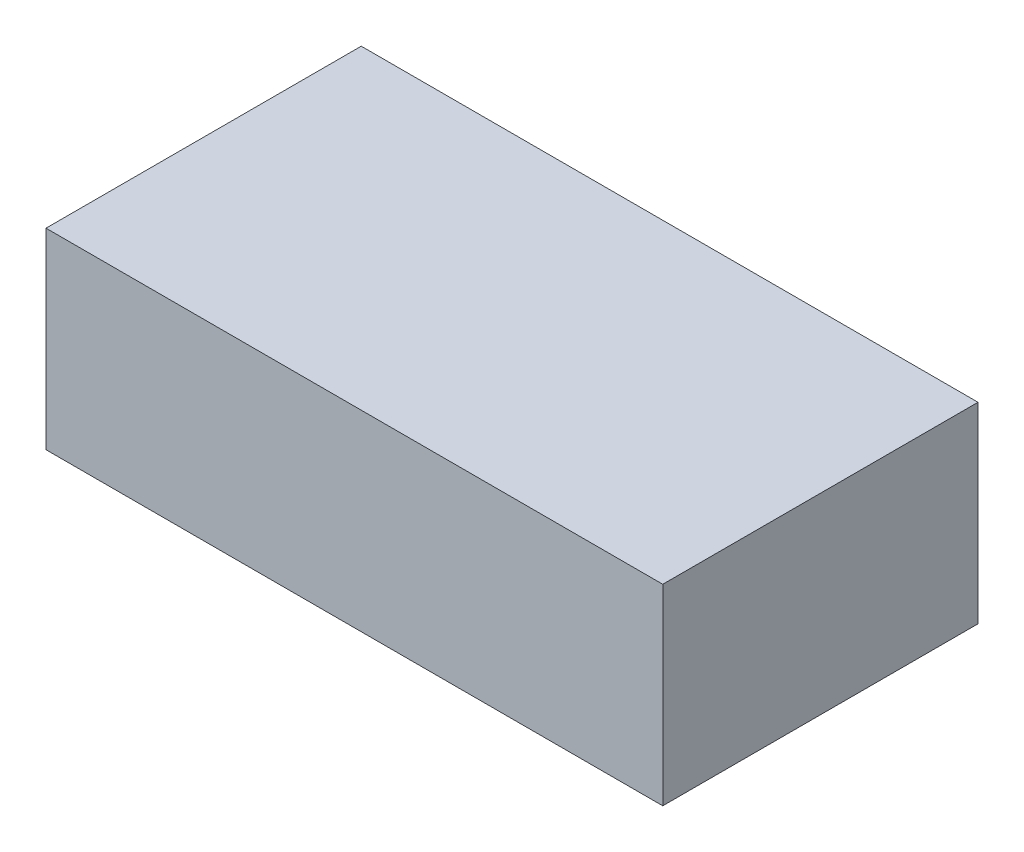
ISO-10303-21;
HEADER;
FILE_DESCRIPTION(('STEP AP214'),'2;1');
FILE_NAME('part.step','',(''),(''),'','','');
FILE_SCHEMA(('AUTOMOTIVE_DESIGN { 1 0 10303 214 1 1 1 1 }'));
ENDSEC;
DATA;
#1=APPLICATION_CONTEXT('core data for automotive mechanical design processes');
#2=APPLICATION_PROTOCOL_DEFINITION('international standard','automotive_design',2000,#1);
#3=PRODUCT_CONTEXT('',#1,'mechanical');
#4=PRODUCT('Part','Part','',(#3));
#5=PRODUCT_RELATED_PRODUCT_CATEGORY('part','',(#4));
#6=PRODUCT_DEFINITION_FORMATION('','',#4);
#7=PRODUCT_DEFINITION_CONTEXT('part definition',#1,'design');
#8=PRODUCT_DEFINITION('design','',#6,#7);
#9=PRODUCT_DEFINITION_SHAPE('','',#8);
#10=(LENGTH_UNIT() NAMED_UNIT(*) SI_UNIT(.MILLI.,.METRE.));
#11=(NAMED_UNIT(*) PLANE_ANGLE_UNIT() SI_UNIT($,.RADIAN.));
#12=(NAMED_UNIT(*) SI_UNIT($,.STERADIAN.) SOLID_ANGLE_UNIT());
#13=UNCERTAINTY_MEASURE_WITH_UNIT(LENGTH_MEASURE(1.E-05),#10,'distance_accuracy_value','');
#14=(GEOMETRIC_REPRESENTATION_CONTEXT(3) GLOBAL_UNCERTAINTY_ASSIGNED_CONTEXT((#13)) GLOBAL_UNIT_ASSIGNED_CONTEXT((#10,
#11,#12)) REPRESENTATION_CONTEXT('',''));
#15=CARTESIAN_POINT('',(0.,0.,0.));
#16=DIRECTION('',(0.,0.,1.));
#17=DIRECTION('',(1.,0.,0.));
#18=AXIS2_PLACEMENT_3D('',#15,#16,#17);
#19=CARTESIAN_POINT('',(22.5,14.,-11.5));
#20=DIRECTION('',(-1.,0.,0.));
#21=DIRECTION('',(0.,0.,1.));
#22=AXIS2_PLACEMENT_3D('',#19,#20,#21);
#23=PLANE('',#22);
#24=DIRECTION('',(0.,0.,-1.));
#25=VECTOR('',#24,1.);
#26=CARTESIAN_POINT('',(22.5,0.,-11.5));
#27=LINE('',#26,#25);
#28=CARTESIAN_POINT('',(22.5,0.,11.5));
#29=VERTEX_POINT('',#28);
#30=CARTESIAN_POINT('',(22.5,0.,-11.5));
#31=VERTEX_POINT('',#30);
#32=EDGE_CURVE('E107',#29,#31,#27,.T.);
#33=ORIENTED_EDGE('',*,*,#32,.T.);
#34=DIRECTION('',(0.,-1.,0.));
#35=VECTOR('',#34,1.);
#36=CARTESIAN_POINT('',(22.5,14.,-11.5));
#37=LINE('',#36,#35);
#38=CARTESIAN_POINT('',(22.5,14.,-11.5));
#39=VERTEX_POINT('',#38);
#40=EDGE_CURVE('E11',#39,#31,#37,.T.);
#41=ORIENTED_EDGE('',*,*,#40,.F.);
#42=DIRECTION('',(0.,0.,-1.));
#43=VECTOR('',#42,1.);
#44=CARTESIAN_POINT('',(22.5,14.,-11.5));
#45=LINE('',#44,#43);
#46=CARTESIAN_POINT('',(22.5,14.,11.5));
#47=VERTEX_POINT('',#46);
#48=EDGE_CURVE('E91',#47,#39,#45,.T.);
#49=ORIENTED_EDGE('',*,*,#48,.F.);
#50=DIRECTION('',(0.,-1.,0.));
#51=VECTOR('',#50,1.);
#52=CARTESIAN_POINT('',(22.5,14.,11.5));
#53=LINE('',#52,#51);
#54=EDGE_CURVE('E103',#47,#29,#53,.T.);
#55=ORIENTED_EDGE('',*,*,#54,.T.);
#56=EDGE_LOOP('',(#33,#41,#49,#55));
#57=FACE_BOUND('',#56,.T.);
#58=ADVANCED_FACE('F39',(#57),#23,.F.);
#59=CARTESIAN_POINT('',(-22.5,14.,-11.5));
#60=DIRECTION('',(0.,0.,1.));
#61=DIRECTION('',(1.,0.,0.));
#62=AXIS2_PLACEMENT_3D('',#59,#60,#61);
#63=PLANE('',#62);
#64=DIRECTION('',(-1.,0.,0.));
#65=VECTOR('',#64,1.);
#66=CARTESIAN_POINT('',(-22.5,0.,-11.5));
#67=LINE('',#66,#65);
#68=CARTESIAN_POINT('',(-22.5,0.,-11.5));
#69=VERTEX_POINT('',#68);
#70=EDGE_CURVE('E96',#31,#69,#67,.T.);
#71=ORIENTED_EDGE('',*,*,#70,.T.);
#72=DIRECTION('',(0.,-1.,0.));
#73=VECTOR('',#72,1.);
#74=CARTESIAN_POINT('',(-22.5,14.,-11.5));
#75=LINE('',#74,#73);
#76=CARTESIAN_POINT('',(-22.5,14.,-11.5));
#77=VERTEX_POINT('',#76);
#78=EDGE_CURVE('E48',#77,#69,#75,.T.);
#79=ORIENTED_EDGE('',*,*,#78,.F.);
#80=DIRECTION('',(-1.,0.,0.));
#81=VECTOR('',#80,1.);
#82=CARTESIAN_POINT('',(-22.5,14.,-11.5));
#83=LINE('',#82,#81);
#84=EDGE_CURVE('E86',#39,#77,#83,.T.);
#85=ORIENTED_EDGE('',*,*,#84,.F.);
#86=ORIENTED_EDGE('',*,*,#40,.T.);
#87=EDGE_LOOP('',(#71,#79,#85,#86));
#88=FACE_BOUND('',#87,.T.);
#89=ADVANCED_FACE('F95',(#88),#63,.F.);
#90=CARTESIAN_POINT('',(-22.5,14.,-11.5));
#91=DIRECTION('',(1.,0.,0.));
#92=DIRECTION('',(0.,0.,-1.));
#93=AXIS2_PLACEMENT_3D('',#90,#91,#92);
#94=PLANE('',#93);
#95=DIRECTION('',(0.,0.,1.));
#96=VECTOR('',#95,1.);
#97=CARTESIAN_POINT('',(-22.5,0.,-11.5));
#98=LINE('',#97,#96);
#99=CARTESIAN_POINT('',(-22.5,0.,11.5));
#100=VERTEX_POINT('',#99);
#101=EDGE_CURVE('E73',#69,#100,#98,.T.);
#102=ORIENTED_EDGE('',*,*,#101,.T.);
#103=DIRECTION('',(0.,-1.,0.));
#104=VECTOR('',#103,1.);
#105=CARTESIAN_POINT('',(-22.5,14.,11.5));
#106=LINE('',#105,#104);
#107=CARTESIAN_POINT('',(-22.5,14.,11.5));
#108=VERTEX_POINT('',#107);
#109=EDGE_CURVE('E98',#108,#100,#106,.T.);
#110=ORIENTED_EDGE('',*,*,#109,.F.);
#111=DIRECTION('',(0.,0.,1.));
#112=VECTOR('',#111,1.);
#113=CARTESIAN_POINT('',(-22.5,14.,-11.5));
#114=LINE('',#113,#112);
#115=EDGE_CURVE('E89',#77,#108,#114,.T.);
#116=ORIENTED_EDGE('',*,*,#115,.F.);
#117=ORIENTED_EDGE('',*,*,#78,.T.);
#118=EDGE_LOOP('',(#102,#110,#116,#117));
#119=FACE_BOUND('',#118,.T.);
#120=ADVANCED_FACE('F99',(#119),#94,.F.);
#121=CARTESIAN_POINT('',(-22.5,14.,11.5));
#122=DIRECTION('',(0.,0.,-1.));
#123=DIRECTION('',(-1.,0.,0.));
#124=AXIS2_PLACEMENT_3D('',#121,#122,#123);
#125=PLANE('',#124);
#126=DIRECTION('',(1.,0.,0.));
#127=VECTOR('',#126,1.);
#128=CARTESIAN_POINT('',(-22.5,0.,11.5));
#129=LINE('',#128,#127);
#130=EDGE_CURVE('E79',#100,#29,#129,.T.);
#131=ORIENTED_EDGE('',*,*,#130,.T.);
#132=ORIENTED_EDGE('',*,*,#54,.F.);
#133=DIRECTION('',(1.,0.,0.));
#134=VECTOR('',#133,1.);
#135=CARTESIAN_POINT('',(-22.5,14.,11.5));
#136=LINE('',#135,#134);
#137=EDGE_CURVE('E56',#108,#47,#136,.T.);
#138=ORIENTED_EDGE('',*,*,#137,.F.);
#139=ORIENTED_EDGE('',*,*,#109,.T.);
#140=EDGE_LOOP('',(#131,#132,#138,#139));
#141=FACE_BOUND('',#140,.T.);
#142=ADVANCED_FACE('F120',(#141),#125,.F.);
#143=CARTESIAN_POINT('',(0.,14.,0.));
#144=DIRECTION('',(0.,1.,0.));
#145=DIRECTION('',(0.,0.,1.));
#146=AXIS2_PLACEMENT_3D('',#143,#144,#145);
#147=PLANE('',#146);
#148=ORIENTED_EDGE('',*,*,#48,.T.);
#149=ORIENTED_EDGE('',*,*,#84,.T.);
#150=ORIENTED_EDGE('',*,*,#115,.T.);
#151=ORIENTED_EDGE('',*,*,#137,.T.);
#152=EDGE_LOOP('',(#148,#149,#150,#151));
#153=FACE_BOUND('',#152,.T.);
#154=ADVANCED_FACE('F87',(#153),#147,.T.);
#155=CARTESIAN_POINT('',(0.,0.,0.));
#156=DIRECTION('',(0.,1.,0.));
#157=DIRECTION('',(0.,0.,1.));
#158=AXIS2_PLACEMENT_3D('',#155,#156,#157);
#159=PLANE('',#158);
#160=ORIENTED_EDGE('',*,*,#32,.F.);
#161=ORIENTED_EDGE('',*,*,#130,.F.);
#162=ORIENTED_EDGE('',*,*,#101,.F.);
#163=ORIENTED_EDGE('',*,*,#70,.F.);
#164=EDGE_LOOP('',(#160,#161,#162,#163));
#165=FACE_BOUND('',#164,.T.);
#166=ADVANCED_FACE('F123',(#165),#159,.F.);
#167=CLOSED_SHELL('',(#58,#89,#120,#142,#154,#166));
#168=MANIFOLD_SOLID_BREP('B2',#167);
#169=ADVANCED_BREP_SHAPE_REPRESENTATION('',(#18,#168),#14);
#170=SHAPE_DEFINITION_REPRESENTATION(#9,#169);
ENDSEC;
END-ISO-10303-21;
